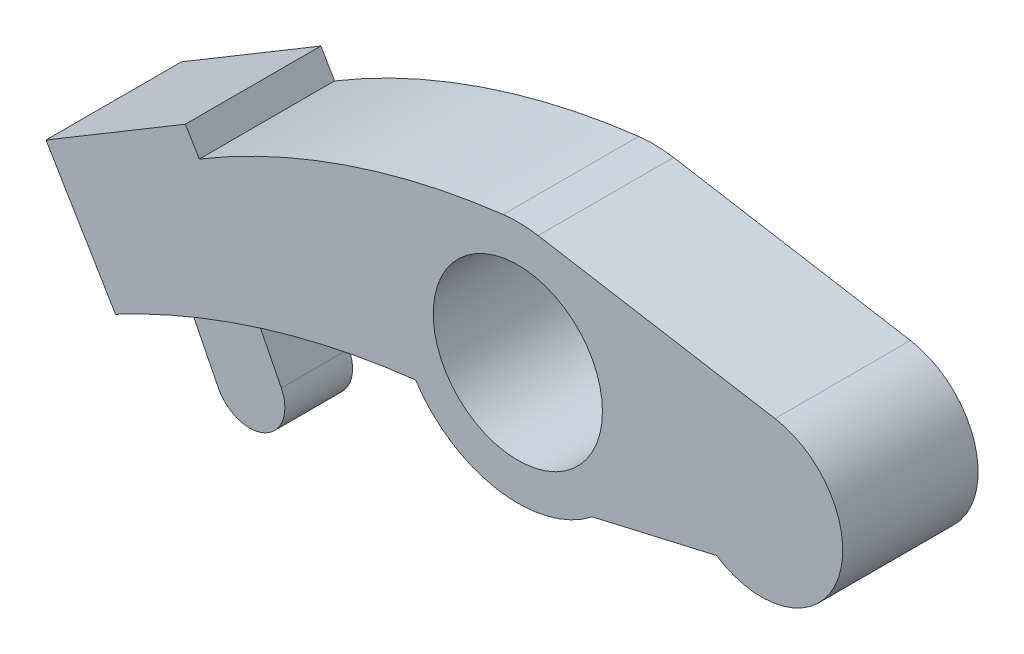
ISO-10303-21;
HEADER;
FILE_DESCRIPTION(('STEP AP214'),'2;1');
FILE_NAME('part.step','',(''),(''),'','','');
FILE_SCHEMA(('AUTOMOTIVE_DESIGN { 1 0 10303 214 1 1 1 1 }'));
ENDSEC;
DATA;
#1=APPLICATION_CONTEXT('core data for automotive mechanical design processes');
#2=APPLICATION_PROTOCOL_DEFINITION('international standard','automotive_design',2000,#1);
#3=PRODUCT_CONTEXT('',#1,'mechanical');
#4=PRODUCT('Part','Part','',(#3));
#5=PRODUCT_RELATED_PRODUCT_CATEGORY('part','',(#4));
#6=PRODUCT_DEFINITION_FORMATION('','',#4);
#7=PRODUCT_DEFINITION_CONTEXT('part definition',#1,'design');
#8=PRODUCT_DEFINITION('design','',#6,#7);
#9=PRODUCT_DEFINITION_SHAPE('','',#8);
#10=(LENGTH_UNIT() NAMED_UNIT(*) SI_UNIT(.MILLI.,.METRE.));
#11=(NAMED_UNIT(*) PLANE_ANGLE_UNIT() SI_UNIT($,.RADIAN.));
#12=(NAMED_UNIT(*) SI_UNIT($,.STERADIAN.) SOLID_ANGLE_UNIT());
#13=UNCERTAINTY_MEASURE_WITH_UNIT(LENGTH_MEASURE(1.E-05),#10,'distance_accuracy_value','');
#14=(GEOMETRIC_REPRESENTATION_CONTEXT(3) GLOBAL_UNCERTAINTY_ASSIGNED_CONTEXT((#13)) GLOBAL_UNIT_ASSIGNED_CONTEXT((#10,
#11,#12)) REPRESENTATION_CONTEXT('',''));
#15=CARTESIAN_POINT('',(0.,0.,0.));
#16=DIRECTION('',(0.,0.,1.));
#17=DIRECTION('',(1.,0.,0.));
#18=AXIS2_PLACEMENT_3D('',#15,#16,#17);
#19=CARTESIAN_POINT('',(-0.582321747076012,-66.4960199271147,5.));
#20=DIRECTION('',(0.,0.,-1.));
#21=DIRECTION('',(-1.,0.,0.));
#22=AXIS2_PLACEMENT_3D('',#19,#20,#21);
#23=CYLINDRICAL_SURFACE('',#22,62.);
#24=DIRECTION('',(0.,0.,-1.));
#25=VECTOR('',#24,1.);
#26=CARTESIAN_POINT('',(-27.0142891750034,-10.4125901292771,2.5));
#27=LINE('',#26,#25);
#28=CARTESIAN_POINT('',(-27.0142891750034,-10.4125901292771,2.5));
#29=VERTEX_POINT('',#28);
#30=CARTESIAN_POINT('',(-27.0142891750034,-10.4125901292771,-2.5));
#31=VERTEX_POINT('',#30);
#32=EDGE_CURVE('E55',#29,#31,#27,.T.);
#33=ORIENTED_EDGE('',*,*,#32,.F.);
#34=CARTESIAN_POINT('',(-0.582321747076012,-66.4960199271147,2.5));
#35=DIRECTION('',(0.,0.,1.));
#36=DIRECTION('',(1.,0.,0.));
#37=AXIS2_PLACEMENT_3D('',#34,#35,#36);
#38=CIRCLE('',#37,62.);
#39=CARTESIAN_POINT('',(-22.2216897414199,-8.39492051578374,2.5));
#40=VERTEX_POINT('',#39);
#41=EDGE_CURVE('E50',#40,#29,#38,.T.);
#42=ORIENTED_EDGE('',*,*,#41,.F.);
#43=DIRECTION('',(0.,0.,-1.));
#44=VECTOR('',#43,1.);
#45=CARTESIAN_POINT('',(-22.2216897414199,-8.39492051578375,2.5));
#46=LINE('',#45,#44);
#47=CARTESIAN_POINT('',(-22.2216897414199,-8.39492051578375,-2.5));
#48=VERTEX_POINT('',#47);
#49=EDGE_CURVE('E167',#40,#48,#46,.T.);
#50=ORIENTED_EDGE('',*,*,#49,.T.);
#51=CARTESIAN_POINT('',(-0.582321747076012,-66.4960199271147,-2.5));
#52=DIRECTION('',(0.,0.,1.));
#53=DIRECTION('',(1.,0.,0.));
#54=AXIS2_PLACEMENT_3D('',#51,#52,#53);
#55=CIRCLE('',#54,62.);
#56=EDGE_CURVE('E160',#48,#31,#55,.T.);
#57=ORIENTED_EDGE('',*,*,#56,.T.);
#58=EDGE_LOOP('',(#33,#42,#50,#57));
#59=FACE_BOUND('',#58,.T.);
#60=CARTESIAN_POINT('',(-0.582321747076012,-66.4960199271147,-5.));
#61=DIRECTION('',(0.,0.,1.));
#62=DIRECTION('',(1.,0.,0.));
#63=AXIS2_PLACEMENT_3D('',#60,#61,#62);
#64=CIRCLE('',#63,62.);
#65=CARTESIAN_POINT('',(-29.72,-11.7694659881988,-5.));
#66=VERTEX_POINT('',#65);
#67=CARTESIAN_POINT('',(-7.55600074091736,-4.88946344737911,-5.));
#68=VERTEX_POINT('',#67);
#69=EDGE_CURVE('E199',#66,#68,#64,.F.);
#70=ORIENTED_EDGE('',*,*,#69,.T.);
#71=DIRECTION('',(0.,0.,-1.));
#72=VECTOR('',#71,1.);
#73=CARTESIAN_POINT('',(-7.55600074091736,-4.88946344737911,5.));
#74=LINE('',#73,#72);
#75=CARTESIAN_POINT('',(-7.55600074091736,-4.88946344737911,5.));
#76=VERTEX_POINT('',#75);
#77=EDGE_CURVE('E11',#76,#68,#74,.T.);
#78=ORIENTED_EDGE('',*,*,#77,.F.);
#79=CARTESIAN_POINT('',(-0.582321747076012,-66.4960199271147,5.));
#80=DIRECTION('',(0.,0.,1.));
#81=DIRECTION('',(1.,0.,0.));
#82=AXIS2_PLACEMENT_3D('',#79,#80,#81);
#83=CIRCLE('',#82,62.);
#84=CARTESIAN_POINT('',(-29.72,-11.7694659881988,5.));
#85=VERTEX_POINT('',#84);
#86=EDGE_CURVE('E173',#85,#76,#83,.F.);
#87=ORIENTED_EDGE('',*,*,#86,.F.);
#88=DIRECTION('',(0.,0.,-1.));
#89=VECTOR('',#88,1.);
#90=CARTESIAN_POINT('',(-29.72,-11.7694659881988,5.));
#91=LINE('',#90,#89);
#92=EDGE_CURVE('E196',#85,#66,#91,.T.);
#93=ORIENTED_EDGE('',*,*,#92,.T.);
#94=EDGE_LOOP('',(#70,#78,#87,#93));
#95=FACE_BOUND('',#94,.T.);
#96=ADVANCED_FACE('F35',(#59,#95),#23,.F.);
#97=CARTESIAN_POINT('',(0.,0.,5.));
#98=DIRECTION('',(0.,0.,-1.));
#99=DIRECTION('',(-1.,0.,0.));
#100=AXIS2_PLACEMENT_3D('',#97,#98,#99);
#101=CYLINDRICAL_SURFACE('',#100,9.);
#102=CARTESIAN_POINT('',(0.,0.,-5.));
#103=DIRECTION('',(0.,0.,1.));
#104=DIRECTION('',(1.,0.,0.));
#105=AXIS2_PLACEMENT_3D('',#102,#103,#104);
#106=CIRCLE('',#105,9.);
#107=CARTESIAN_POINT('',(5.50692711993437,-7.11854997142897,-5.));
#108=VERTEX_POINT('',#107);
#109=EDGE_CURVE('E202',#68,#108,#106,.T.);
#110=ORIENTED_EDGE('',*,*,#109,.T.);
#111=DIRECTION('',(0.,0.,-1.));
#112=VECTOR('',#111,1.);
#113=CARTESIAN_POINT('',(5.50692711993437,-7.11854997142897,5.));
#114=LINE('',#113,#112);
#115=CARTESIAN_POINT('',(5.50692711993437,-7.11854997142897,5.));
#116=VERTEX_POINT('',#115);
#117=EDGE_CURVE('E43',#116,#108,#114,.T.);
#118=ORIENTED_EDGE('',*,*,#117,.F.);
#119=CARTESIAN_POINT('',(0.,0.,5.));
#120=DIRECTION('',(0.,0.,1.));
#121=DIRECTION('',(1.,0.,0.));
#122=AXIS2_PLACEMENT_3D('',#119,#120,#121);
#123=CIRCLE('',#122,9.);
#124=EDGE_CURVE('E177',#76,#116,#123,.T.);
#125=ORIENTED_EDGE('',*,*,#124,.F.);
#126=ORIENTED_EDGE('',*,*,#77,.T.);
#127=EDGE_LOOP('',(#110,#118,#125,#126));
#128=FACE_BOUND('',#127,.T.);
#129=ADVANCED_FACE('F248',(#128),#101,.T.);
#130=CARTESIAN_POINT('',(1.83895036279225,-7.96536913044095,5.));
#131=DIRECTION('',(0.224951054343859,-0.974370064785237,0.));
#132=DIRECTION('',(0.974370064785237,0.224951054343859,0.));
#133=AXIS2_PLACEMENT_3D('',#130,#131,#132);
#134=PLANE('',#133);
#135=DIRECTION('',(-0.974370064785237,-0.224951054343859,0.));
#136=VECTOR('',#135,1.);
#137=CARTESIAN_POINT('',(1.83895036279225,-7.96536913044095,-5.));
#138=LINE('',#137,#136);
#139=CARTESIAN_POINT('',(14.6833752096446,-5.,-5.));
#140=VERTEX_POINT('',#139);
#141=EDGE_CURVE('E205',#140,#108,#138,.T.);
#142=ORIENTED_EDGE('',*,*,#141,.F.);
#143=DIRECTION('',(0.,0.,-1.));
#144=VECTOR('',#143,1.);
#145=CARTESIAN_POINT('',(14.6833752096446,-5.,5.));
#146=LINE('',#145,#144);
#147=CARTESIAN_POINT('',(14.6833752096446,-5.,5.));
#148=VERTEX_POINT('',#147);
#149=EDGE_CURVE('E241',#148,#140,#146,.T.);
#150=ORIENTED_EDGE('',*,*,#149,.F.);
#151=DIRECTION('',(-0.974370064785237,-0.224951054343859,0.));
#152=VECTOR('',#151,1.);
#153=CARTESIAN_POINT('',(1.83895036279225,-7.96536913044095,5.));
#154=LINE('',#153,#152);
#155=EDGE_CURVE('E179',#148,#116,#154,.T.);
#156=ORIENTED_EDGE('',*,*,#155,.T.);
#157=ORIENTED_EDGE('',*,*,#117,.T.);
#158=EDGE_LOOP('',(#142,#150,#156,#157));
#159=FACE_BOUND('',#158,.T.);
#160=ADVANCED_FACE('F245',(#159),#134,.T.);
#161=CARTESIAN_POINT('',(18.,0.,5.));
#162=DIRECTION('',(0.,0.,-1.));
#163=DIRECTION('',(-1.,0.,0.));
#164=AXIS2_PLACEMENT_3D('',#161,#162,#163);
#165=CYLINDRICAL_SURFACE('',#164,6.);
#166=CARTESIAN_POINT('',(18.,0.,-5.));
#167=DIRECTION('',(0.,0.,1.));
#168=DIRECTION('',(1.,0.,0.));
#169=AXIS2_PLACEMENT_3D('',#166,#167,#168);
#170=CIRCLE('',#169,6.);
#171=CARTESIAN_POINT('',(19.,5.91607978309962,-5.));
#172=VERTEX_POINT('',#171);
#173=EDGE_CURVE('E208',#140,#172,#170,.T.);
#174=ORIENTED_EDGE('',*,*,#173,.T.);
#175=DIRECTION('',(0.,0.,-1.));
#176=VECTOR('',#175,1.);
#177=CARTESIAN_POINT('',(19.,5.91607978309962,5.));
#178=LINE('',#177,#176);
#179=CARTESIAN_POINT('',(19.,5.91607978309962,5.));
#180=VERTEX_POINT('',#179);
#181=EDGE_CURVE('E238',#180,#172,#178,.T.);
#182=ORIENTED_EDGE('',*,*,#181,.F.);
#183=CARTESIAN_POINT('',(18.,0.,5.));
#184=DIRECTION('',(0.,0.,1.));
#185=DIRECTION('',(1.,0.,0.));
#186=AXIS2_PLACEMENT_3D('',#183,#184,#185);
#187=CIRCLE('',#186,6.);
#188=EDGE_CURVE('E182',#148,#180,#187,.T.);
#189=ORIENTED_EDGE('',*,*,#188,.F.);
#190=ORIENTED_EDGE('',*,*,#149,.T.);
#191=EDGE_LOOP('',(#174,#182,#189,#190));
#192=FACE_BOUND('',#191,.T.);
#193=ADVANCED_FACE('F258',(#192),#165,.T.);
#194=CARTESIAN_POINT('',(1.5,8.87411967464942,5.));
#195=DIRECTION('',(-0.166666666666667,-0.986013297183269,0.));
#196=DIRECTION('',(0.986013297183269,-0.166666666666667,0.));
#197=AXIS2_PLACEMENT_3D('',#194,#195,#196);
#198=PLANE('',#197);
#199=DIRECTION('',(-0.986013297183269,0.166666666666667,0.));
#200=VECTOR('',#199,1.);
#201=CARTESIAN_POINT('',(1.5,8.87411967464942,-5.));
#202=LINE('',#201,#200);
#203=CARTESIAN_POINT('',(1.5,8.87411967464943,-5.));
#204=VERTEX_POINT('',#203);
#205=EDGE_CURVE('E210',#172,#204,#202,.T.);
#206=ORIENTED_EDGE('',*,*,#205,.T.);
#207=DIRECTION('',(0.,0.,-1.));
#208=VECTOR('',#207,1.);
#209=CARTESIAN_POINT('',(1.5,8.87411967464943,5.));
#210=LINE('',#209,#208);
#211=CARTESIAN_POINT('',(1.5,8.87411967464943,5.));
#212=VERTEX_POINT('',#211);
#213=EDGE_CURVE('E235',#212,#204,#210,.T.);
#214=ORIENTED_EDGE('',*,*,#213,.F.);
#215=DIRECTION('',(-0.986013297183269,0.166666666666667,0.));
#216=VECTOR('',#215,1.);
#217=CARTESIAN_POINT('',(1.5,8.87411967464942,5.));
#218=LINE('',#217,#216);
#219=EDGE_CURVE('E184',#180,#212,#218,.T.);
#220=ORIENTED_EDGE('',*,*,#219,.F.);
#221=ORIENTED_EDGE('',*,*,#181,.T.);
#222=EDGE_LOOP('',(#206,#214,#220,#221));
#223=FACE_BOUND('',#222,.T.);
#224=ADVANCED_FACE('F262',(#223),#198,.F.);
#225=CARTESIAN_POINT('',(0.,0.,5.));
#226=DIRECTION('',(0.,0.,-1.));
#227=DIRECTION('',(-1.,0.,0.));
#228=AXIS2_PLACEMENT_3D('',#225,#226,#227);
#229=CYLINDRICAL_SURFACE('',#228,9.);
#230=CARTESIAN_POINT('',(0.,0.,-5.));
#231=DIRECTION('',(0.,0.,1.));
#232=DIRECTION('',(1.,0.,0.));
#233=AXIS2_PLACEMENT_3D('',#230,#231,#232);
#234=CIRCLE('',#233,9.);
#235=CARTESIAN_POINT('',(-1.07557753899436,8.93549847281117,-5.));
#236=VERTEX_POINT('',#235);
#237=EDGE_CURVE('E212',#204,#236,#234,.T.);
#238=ORIENTED_EDGE('',*,*,#237,.T.);
#239=DIRECTION('',(0.,0.,-1.));
#240=VECTOR('',#239,1.);
#241=CARTESIAN_POINT('',(-1.07557753899436,8.93549847281117,5.));
#242=LINE('',#241,#240);
#243=CARTESIAN_POINT('',(-1.07557753899436,8.93549847281117,5.));
#244=VERTEX_POINT('',#243);
#245=EDGE_CURVE('E232',#244,#236,#242,.T.);
#246=ORIENTED_EDGE('',*,*,#245,.F.);
#247=CARTESIAN_POINT('',(0.,0.,5.));
#248=DIRECTION('',(0.,0.,1.));
#249=DIRECTION('',(1.,0.,0.));
#250=AXIS2_PLACEMENT_3D('',#247,#248,#249);
#251=CIRCLE('',#250,9.);
#252=EDGE_CURVE('E186',#212,#244,#251,.T.);
#253=ORIENTED_EDGE('',*,*,#252,.F.);
#254=ORIENTED_EDGE('',*,*,#213,.T.);
#255=EDGE_LOOP('',(#238,#246,#253,#254));
#256=FACE_BOUND('',#255,.T.);
#257=ADVANCED_FACE('F291',(#256),#229,.T.);
#258=CARTESIAN_POINT('',(5.73641354130325,-47.6559918549929,5.));
#259=DIRECTION('',(0.,0.,-1.));
#260=DIRECTION('',(-1.,0.,0.));
#261=AXIS2_PLACEMENT_3D('',#258,#259,#260);
#262=CYLINDRICAL_SURFACE('',#261,57.);
#263=CARTESIAN_POINT('',(5.73641354130325,-47.6559918549929,-5.));
#264=DIRECTION('',(0.,0.,1.));
#265=DIRECTION('',(1.,0.,0.));
#266=AXIS2_PLACEMENT_3D('',#263,#264,#265);
#267=CIRCLE('',#266,57.);
#268=CARTESIAN_POINT('',(-23.5301402221438,1.25687793212203,-5.));
#269=VERTEX_POINT('',#268);
#270=EDGE_CURVE('E214',#236,#269,#267,.T.);
#271=ORIENTED_EDGE('',*,*,#270,.T.);
#272=DIRECTION('',(0.,0.,-1.));
#273=VECTOR('',#272,1.);
#274=CARTESIAN_POINT('',(-23.5301402221438,1.25687793212203,5.));
#275=LINE('',#274,#273);
#276=CARTESIAN_POINT('',(-23.5301402221438,1.25687793212203,5.));
#277=VERTEX_POINT('',#276);
#278=EDGE_CURVE('E229',#277,#269,#275,.T.);
#279=ORIENTED_EDGE('',*,*,#278,.F.);
#280=CARTESIAN_POINT('',(5.73641354130325,-47.6559918549929,5.));
#281=DIRECTION('',(0.,0.,1.));
#282=DIRECTION('',(1.,0.,0.));
#283=AXIS2_PLACEMENT_3D('',#280,#281,#282);
#284=CIRCLE('',#283,57.);
#285=EDGE_CURVE('E188',#244,#277,#284,.T.);
#286=ORIENTED_EDGE('',*,*,#285,.F.);
#287=ORIENTED_EDGE('',*,*,#245,.T.);
#288=EDGE_LOOP('',(#271,#279,#286,#287));
#289=FACE_BOUND('',#288,.T.);
#290=ADVANCED_FACE('F288',(#289),#262,.T.);
#291=CARTESIAN_POINT('',(-16.7731278279483,-10.0360426508267,5.));
#292=DIRECTION('',(-0.858120522580965,-0.513448311639421,0.));
#293=DIRECTION('',(0.513448311639421,-0.858120522580965,0.));
#294=AXIS2_PLACEMENT_3D('',#291,#292,#293);
#295=PLANE('',#294);
#296=DIRECTION('',(-0.513448311639421,0.858120522580965,0.));
#297=VECTOR('',#296,1.);
#298=CARTESIAN_POINT('',(-16.7731278279483,-10.0360426508267,-5.));
#299=LINE('',#298,#297);
#300=CARTESIAN_POINT('',(-24.5570368454226,2.97311897728395,-5.));
#301=VERTEX_POINT('',#300);
#302=EDGE_CURVE('E216',#269,#301,#299,.T.);
#303=ORIENTED_EDGE('',*,*,#302,.T.);
#304=DIRECTION('',(0.,0.,-1.));
#305=VECTOR('',#304,1.);
#306=CARTESIAN_POINT('',(-24.5570368454226,2.97311897728395,5.));
#307=LINE('',#306,#305);
#308=CARTESIAN_POINT('',(-24.5570368454226,2.97311897728395,5.));
#309=VERTEX_POINT('',#308);
#310=EDGE_CURVE('E226',#309,#301,#307,.T.);
#311=ORIENTED_EDGE('',*,*,#310,.F.);
#312=DIRECTION('',(-0.513448311639421,0.858120522580965,0.));
#313=VECTOR('',#312,1.);
#314=CARTESIAN_POINT('',(-16.7731278279483,-10.0360426508267,5.));
#315=LINE('',#314,#313);
#316=EDGE_CURVE('E190',#277,#309,#315,.T.);
#317=ORIENTED_EDGE('',*,*,#316,.F.);
#318=ORIENTED_EDGE('',*,*,#278,.T.);
#319=EDGE_LOOP('',(#303,#311,#317,#318));
#320=FACE_BOUND('',#319,.T.);
#321=ADVANCED_FACE('F284',(#320),#295,.F.);
#322=CARTESIAN_POINT('',(-7.78390901747435,13.0091616281107,5.));
#323=DIRECTION('',(0.513448311639422,-0.858120522580964,0.));
#324=DIRECTION('',(0.858120522580964,0.513448311639422,0.));
#325=AXIS2_PLACEMENT_3D('',#322,#323,#324);
#326=PLANE('',#325);
#327=DIRECTION('',(-0.858120522580964,-0.513448311639422,0.));
#328=VECTOR('',#327,1.);
#329=CARTESIAN_POINT('',(-7.78390901747435,13.0091616281107,-5.));
#330=LINE('',#329,#328);
#331=CARTESIAN_POINT('',(-34.8544831163942,-3.18826076238911,-5.));
#332=VERTEX_POINT('',#331);
#333=EDGE_CURVE('E218',#301,#332,#330,.T.);
#334=ORIENTED_EDGE('',*,*,#333,.T.);
#335=DIRECTION('',(0.,0.,-1.));
#336=VECTOR('',#335,1.);
#337=CARTESIAN_POINT('',(-34.8544831163942,-3.18826076238911,5.));
#338=LINE('',#337,#336);
#339=CARTESIAN_POINT('',(-34.8544831163942,-3.18826076238911,5.));
#340=VERTEX_POINT('',#339);
#341=EDGE_CURVE('E223',#340,#332,#338,.T.);
#342=ORIENTED_EDGE('',*,*,#341,.F.);
#343=DIRECTION('',(-0.858120522580964,-0.513448311639422,0.));
#344=VECTOR('',#343,1.);
#345=CARTESIAN_POINT('',(-7.78390901747435,13.0091616281107,5.));
#346=LINE('',#345,#344);
#347=EDGE_CURVE('E192',#309,#340,#346,.T.);
#348=ORIENTED_EDGE('',*,*,#347,.F.);
#349=ORIENTED_EDGE('',*,*,#310,.T.);
#350=EDGE_LOOP('',(#334,#342,#348,#349));
#351=FACE_BOUND('',#350,.T.);
#352=ADVANCED_FACE('F280',(#351),#326,.F.);
#353=CARTESIAN_POINT('',(0.,0.,5.));
#354=DIRECTION('',(0.,0.,-1.));
#355=DIRECTION('',(-1.,0.,0.));
#356=AXIS2_PLACEMENT_3D('',#353,#354,#355);
#357=CYLINDRICAL_SURFACE('',#356,6.25);
#358=CARTESIAN_POINT('',(0.,0.,5.));
#359=DIRECTION('',(0.,0.,1.));
#360=DIRECTION('',(1.,0.,0.));
#361=AXIS2_PLACEMENT_3D('',#358,#359,#360);
#362=CIRCLE('',#361,6.25);
#363=CARTESIAN_POINT('',(6.25,0.,5.));
#364=VERTEX_POINT('',#363);
#365=EDGE_CURVE('E170',#364,#364,#362,.T.);
#366=ORIENTED_EDGE('',*,*,#365,.T.);
#367=EDGE_LOOP('',(#366));
#368=FACE_BOUND('',#367,.T.);
#369=CARTESIAN_POINT('',(0.,0.,-5.));
#370=DIRECTION('',(0.,0.,1.));
#371=DIRECTION('',(1.,0.,0.));
#372=AXIS2_PLACEMENT_3D('',#369,#370,#371);
#373=CIRCLE('',#372,6.25);
#374=CARTESIAN_POINT('',(6.25,0.,-5.));
#375=VERTEX_POINT('',#374);
#376=EDGE_CURVE('E169',#375,#375,#373,.T.);
#377=ORIENTED_EDGE('',*,*,#376,.F.);
#378=EDGE_LOOP('',(#377));
#379=FACE_BOUND('',#378,.T.);
#380=ADVANCED_FACE('F37',(#368,#379),#357,.F.);
#381=CARTESIAN_POINT('',(-27.0705740989199,-16.1974223904998,5.));
#382=DIRECTION('',(0.858120522580964,0.513448311639422,0.));
#383=DIRECTION('',(-0.513448311639422,0.858120522580964,0.));
#384=AXIS2_PLACEMENT_3D('',#381,#382,#383);
#385=PLANE('',#384);
#386=DIRECTION('',(0.513448311639422,-0.858120522580964,0.));
#387=VECTOR('',#386,1.);
#388=CARTESIAN_POINT('',(-27.0705740989199,-16.1974223904998,-5.));
#389=LINE('',#388,#387);
#390=EDGE_CURVE('E174',#332,#66,#389,.T.);
#391=ORIENTED_EDGE('',*,*,#390,.T.);
#392=ORIENTED_EDGE('',*,*,#92,.F.);
#393=DIRECTION('',(0.513448311639422,-0.858120522580964,0.));
#394=VECTOR('',#393,1.);
#395=CARTESIAN_POINT('',(-27.0705740989199,-16.1974223904998,5.));
#396=LINE('',#395,#394);
#397=EDGE_CURVE('E194',#340,#85,#396,.T.);
#398=ORIENTED_EDGE('',*,*,#397,.F.);
#399=ORIENTED_EDGE('',*,*,#341,.T.);
#400=EDGE_LOOP('',(#391,#392,#398,#399));
#401=FACE_BOUND('',#400,.T.);
#402=ADVANCED_FACE('F276',(#401),#385,.F.);
#403=CARTESIAN_POINT('',(0.,0.,5.));
#404=DIRECTION('',(0.,0.,1.));
#405=DIRECTION('',(1.,0.,0.));
#406=AXIS2_PLACEMENT_3D('',#403,#404,#405);
#407=PLANE('',#406);
#408=ORIENTED_EDGE('',*,*,#365,.F.);
#409=EDGE_LOOP('',(#408));
#410=FACE_BOUND('',#409,.T.);
#411=ORIENTED_EDGE('',*,*,#86,.T.);
#412=ORIENTED_EDGE('',*,*,#124,.T.);
#413=ORIENTED_EDGE('',*,*,#155,.F.);
#414=ORIENTED_EDGE('',*,*,#188,.T.);
#415=ORIENTED_EDGE('',*,*,#219,.T.);
#416=ORIENTED_EDGE('',*,*,#252,.T.);
#417=ORIENTED_EDGE('',*,*,#285,.T.);
#418=ORIENTED_EDGE('',*,*,#316,.T.);
#419=ORIENTED_EDGE('',*,*,#347,.T.);
#420=ORIENTED_EDGE('',*,*,#397,.T.);
#421=EDGE_LOOP('',(#411,#412,#413,#414,#415,#416,#417,#418,#419,#420));
#422=FACE_BOUND('',#421,.T.);
#423=ADVANCED_FACE('F266',(#410,#422),#407,.T.);
#424=CARTESIAN_POINT('',(0.,0.,-5.));
#425=DIRECTION('',(0.,0.,1.));
#426=DIRECTION('',(1.,0.,0.));
#427=AXIS2_PLACEMENT_3D('',#424,#425,#426);
#428=PLANE('',#427);
#429=ORIENTED_EDGE('',*,*,#376,.T.);
#430=EDGE_LOOP('',(#429));
#431=FACE_BOUND('',#430,.T.);
#432=ORIENTED_EDGE('',*,*,#69,.F.);
#433=ORIENTED_EDGE('',*,*,#390,.F.);
#434=ORIENTED_EDGE('',*,*,#333,.F.);
#435=ORIENTED_EDGE('',*,*,#302,.F.);
#436=ORIENTED_EDGE('',*,*,#270,.F.);
#437=ORIENTED_EDGE('',*,*,#237,.F.);
#438=ORIENTED_EDGE('',*,*,#205,.F.);
#439=ORIENTED_EDGE('',*,*,#173,.F.);
#440=ORIENTED_EDGE('',*,*,#141,.T.);
#441=ORIENTED_EDGE('',*,*,#109,.F.);
#442=EDGE_LOOP('',(#432,#433,#434,#435,#436,#437,#438,#439,#440,#441));
#443=FACE_BOUND('',#442,.T.);
#444=ADVANCED_FACE('F253',(#431,#443),#428,.F.);
#445=CARTESIAN_POINT('',(-21.0919583420403,-10.6353885139374,2.5));
#446=DIRECTION('',(-0.892908041442119,-0.450239080409508,0.));
#447=DIRECTION('',(0.450239080409508,-0.892908041442119,0.));
#448=AXIS2_PLACEMENT_3D('',#445,#446,#447);
#449=PLANE('',#448);
#450=DIRECTION('',(-0.450239080409508,0.892908041442119,0.));
#451=VECTOR('',#450,1.);
#452=CARTESIAN_POINT('',(-21.0919583420403,-10.6353885139374,-2.5));
#453=LINE('',#452,#451);
#454=CARTESIAN_POINT('',(-19.9704943393723,-12.8594607229943,-2.5));
#455=VERTEX_POINT('',#454);
#456=EDGE_CURVE('E157',#455,#48,#453,.T.);
#457=ORIENTED_EDGE('',*,*,#456,.T.);
#458=ORIENTED_EDGE('',*,*,#49,.F.);
#459=DIRECTION('',(-0.450239080409508,0.892908041442119,0.));
#460=VECTOR('',#459,1.);
#461=CARTESIAN_POINT('',(-21.0919583420403,-10.6353885139374,2.5));
#462=LINE('',#461,#460);
#463=CARTESIAN_POINT('',(-19.9704943393723,-12.8594607229943,2.5));
#464=VERTEX_POINT('',#463);
#465=EDGE_CURVE('E164',#464,#40,#462,.T.);
#466=ORIENTED_EDGE('',*,*,#465,.F.);
#467=DIRECTION('',(0.,0.,-1.));
#468=VECTOR('',#467,1.);
#469=CARTESIAN_POINT('',(-19.9704943393723,-12.8594607229943,2.5));
#470=LINE('',#469,#468);
#471=EDGE_CURVE('E148',#464,#455,#470,.T.);
#472=ORIENTED_EDGE('',*,*,#471,.T.);
#473=EDGE_LOOP('',(#457,#458,#466,#472));
#474=FACE_BOUND('',#473,.T.);
#475=ADVANCED_FACE('F376',(#474),#449,.F.);
#476=CARTESIAN_POINT('',(-25.7581801447591,-12.9173644445996,2.5));
#477=DIRECTION('',(0.89389526015902,0.448275879191863,0.));
#478=DIRECTION('',(-0.448275879191863,0.89389526015902,0.));
#479=AXIS2_PLACEMENT_3D('',#476,#477,#478);
#480=PLANE('',#479);
#481=DIRECTION('',(0.448275879191863,-0.89389526015902,0.));
#482=VECTOR('',#481,1.);
#483=CARTESIAN_POINT('',(-25.7581801447591,-12.9173644445996,-2.5));
#484=LINE('',#483,#482);
#485=CARTESIAN_POINT('',(-24.6492859925082,-15.128581404348,-2.5));
#486=VERTEX_POINT('',#485);
#487=EDGE_CURVE('E145',#31,#486,#484,.T.);
#488=ORIENTED_EDGE('',*,*,#487,.T.);
#489=DIRECTION('',(0.,0.,-1.));
#490=VECTOR('',#489,1.);
#491=CARTESIAN_POINT('',(-24.6492859925082,-15.128581404348,2.5));
#492=LINE('',#491,#490);
#493=CARTESIAN_POINT('',(-24.6492859925082,-15.128581404348,2.5));
#494=VERTEX_POINT('',#493);
#495=EDGE_CURVE('E142',#494,#486,#492,.T.);
#496=ORIENTED_EDGE('',*,*,#495,.F.);
#497=DIRECTION('',(0.448275879191863,-0.89389526015902,0.));
#498=VECTOR('',#497,1.);
#499=CARTESIAN_POINT('',(-25.7581801447591,-12.9173644445996,2.5));
#500=LINE('',#499,#498);
#501=EDGE_CURVE('E133',#29,#494,#500,.T.);
#502=ORIENTED_EDGE('',*,*,#501,.F.);
#503=ORIENTED_EDGE('',*,*,#32,.T.);
#504=EDGE_LOOP('',(#488,#496,#502,#503));
#505=FACE_BOUND('',#504,.T.);
#506=ADVANCED_FACE('F143',(#505),#480,.F.);
#507=CARTESIAN_POINT('',(-22.3098901659402,-13.9940210636711,2.5));
#508=DIRECTION('',(0.,0.,-1.));
#509=DIRECTION('',(-1.,0.,0.));
#510=AXIS2_PLACEMENT_3D('',#507,#508,#509);
#511=CYLINDRICAL_SURFACE('',#510,2.6);
#512=CARTESIAN_POINT('',(-22.3098901659402,-13.9940210636711,-2.5));
#513=DIRECTION('',(0.,0.,1.));
#514=DIRECTION('',(1.,0.,0.));
#515=AXIS2_PLACEMENT_3D('',#512,#513,#514);
#516=CIRCLE('',#515,2.6);
#517=EDGE_CURVE('E163',#486,#455,#516,.T.);
#518=ORIENTED_EDGE('',*,*,#517,.T.);
#519=ORIENTED_EDGE('',*,*,#471,.F.);
#520=CARTESIAN_POINT('',(-22.3098901659402,-13.9940210636711,2.5));
#521=DIRECTION('',(0.,0.,1.));
#522=DIRECTION('',(1.,0.,0.));
#523=AXIS2_PLACEMENT_3D('',#520,#521,#522);
#524=CIRCLE('',#523,2.6);
#525=EDGE_CURVE('E137',#494,#464,#524,.T.);
#526=ORIENTED_EDGE('',*,*,#525,.F.);
#527=ORIENTED_EDGE('',*,*,#495,.T.);
#528=EDGE_LOOP('',(#518,#519,#526,#527));
#529=FACE_BOUND('',#528,.T.);
#530=ADVANCED_FACE('F150',(#529),#511,.T.);
#531=CARTESIAN_POINT('',(0.,0.,2.5));
#532=DIRECTION('',(0.,0.,1.));
#533=DIRECTION('',(1.,0.,0.));
#534=AXIS2_PLACEMENT_3D('',#531,#532,#533);
#535=PLANE('',#534);
#536=ORIENTED_EDGE('',*,*,#465,.T.);
#537=ORIENTED_EDGE('',*,*,#41,.T.);
#538=ORIENTED_EDGE('',*,*,#501,.T.);
#539=ORIENTED_EDGE('',*,*,#525,.T.);
#540=EDGE_LOOP('',(#536,#537,#538,#539));
#541=FACE_BOUND('',#540,.T.);
#542=ADVANCED_FACE('F135',(#541),#535,.T.);
#543=CARTESIAN_POINT('',(0.,0.,-2.5));
#544=DIRECTION('',(0.,0.,1.));
#545=DIRECTION('',(1.,0.,0.));
#546=AXIS2_PLACEMENT_3D('',#543,#544,#545);
#547=PLANE('',#546);
#548=ORIENTED_EDGE('',*,*,#456,.F.);
#549=ORIENTED_EDGE('',*,*,#517,.F.);
#550=ORIENTED_EDGE('',*,*,#487,.F.);
#551=ORIENTED_EDGE('',*,*,#56,.F.);
#552=EDGE_LOOP('',(#548,#549,#550,#551));
#553=FACE_BOUND('',#552,.T.);
#554=ADVANCED_FACE('F417',(#553),#547,.F.);
#555=CLOSED_SHELL('',(#96,#129,#160,#193,#224,#257,#290,#321,#352,#380,#402,#423,#444,#475,#506,
#530,#542,#554));
#556=MANIFOLD_SOLID_BREP('B2',#555);
#557=ADVANCED_BREP_SHAPE_REPRESENTATION('',(#18,#556),#14);
#558=SHAPE_DEFINITION_REPRESENTATION(#9,#557);
ENDSEC;
END-ISO-10303-21;
